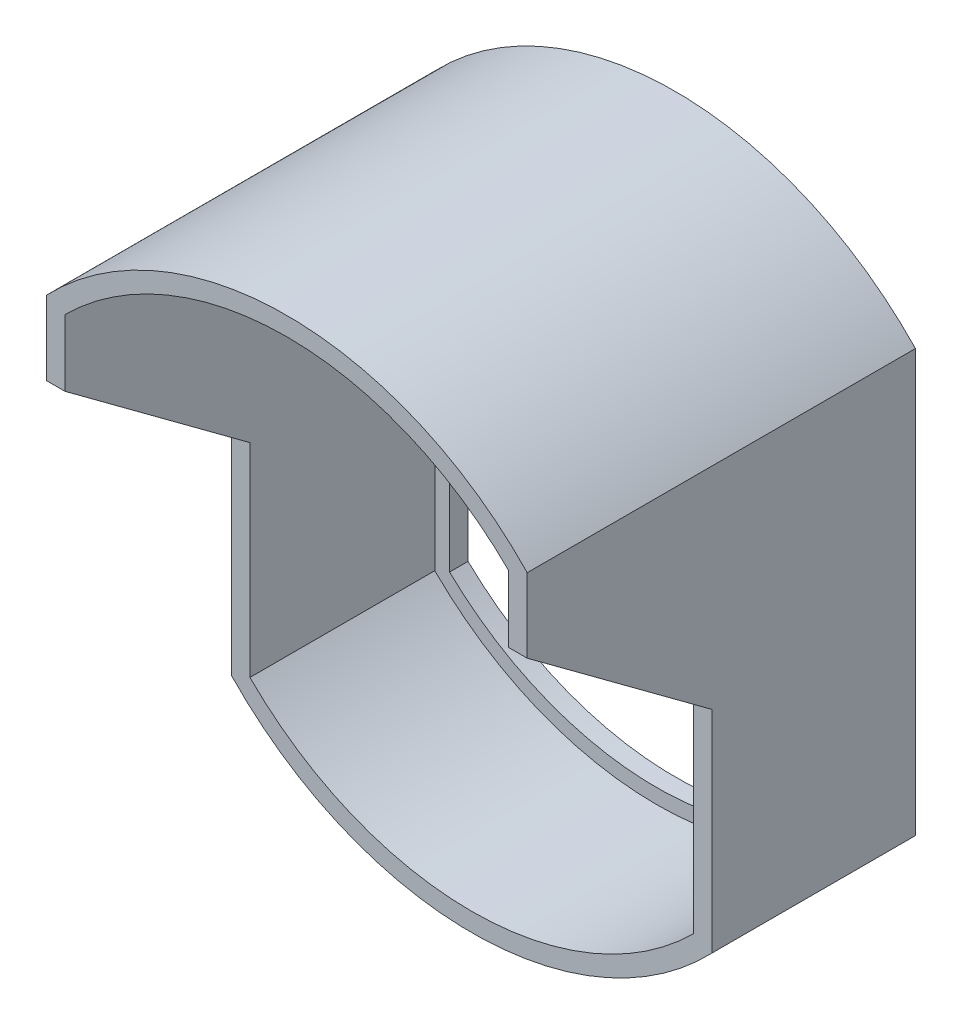
ISO-10303-21;
HEADER;
FILE_DESCRIPTION(('STEP AP214'),'2;1');
FILE_NAME('part.step','',(''),(''),'','','');
FILE_SCHEMA(('AUTOMOTIVE_DESIGN { 1 0 10303 214 1 1 1 1 }'));
ENDSEC;
DATA;
#1=APPLICATION_CONTEXT('core data for automotive mechanical design processes');
#2=APPLICATION_PROTOCOL_DEFINITION('international standard','automotive_design',2000,#1);
#3=PRODUCT_CONTEXT('',#1,'mechanical');
#4=PRODUCT('Part','Part','',(#3));
#5=PRODUCT_RELATED_PRODUCT_CATEGORY('part','',(#4));
#6=PRODUCT_DEFINITION_FORMATION('','',#4);
#7=PRODUCT_DEFINITION_CONTEXT('part definition',#1,'design');
#8=PRODUCT_DEFINITION('design','',#6,#7);
#9=PRODUCT_DEFINITION_SHAPE('','',#8);
#10=(LENGTH_UNIT() NAMED_UNIT(*) SI_UNIT(.MILLI.,.METRE.));
#11=(NAMED_UNIT(*) PLANE_ANGLE_UNIT() SI_UNIT($,.RADIAN.));
#12=(NAMED_UNIT(*) SI_UNIT($,.STERADIAN.) SOLID_ANGLE_UNIT());
#13=UNCERTAINTY_MEASURE_WITH_UNIT(LENGTH_MEASURE(1.E-05),#10,'distance_accuracy_value','');
#14=(GEOMETRIC_REPRESENTATION_CONTEXT(3) GLOBAL_UNCERTAINTY_ASSIGNED_CONTEXT((#13)) GLOBAL_UNIT_ASSIGNED_CONTEXT((#10,
#11,#12)) REPRESENTATION_CONTEXT('',''));
#15=CARTESIAN_POINT('',(0.,0.,0.));
#16=DIRECTION('',(0.,0.,1.));
#17=DIRECTION('',(1.,0.,0.));
#18=AXIS2_PLACEMENT_3D('',#15,#16,#17);
#19=CARTESIAN_POINT('',(120.,-110.,100.));
#20=DIRECTION('',(1.,0.,0.));
#21=DIRECTION('',(0.,1.,0.));
#22=AXIS2_PLACEMENT_3D('',#19,#20,#21);
#23=PLANE('',#22);
#24=DIRECTION('',(0.,0.,-1.));
#25=VECTOR('',#24,1.);
#26=CARTESIAN_POINT('',(120.,-110.,100.));
#27=LINE('',#26,#25);
#28=CARTESIAN_POINT('',(120.,-110.,50.));
#29=VERTEX_POINT('',#28);
#30=CARTESIAN_POINT('',(120.,-110.,0.));
#31=VERTEX_POINT('',#30);
#32=EDGE_CURVE('E240',#29,#31,#27,.T.);
#33=ORIENTED_EDGE('',*,*,#32,.F.);
#34=DIRECTION('',(0.,1.,0.));
#35=VECTOR('',#34,1.);
#36=CARTESIAN_POINT('',(120.,-110.,50.));
#37=LINE('',#36,#35);
#38=CARTESIAN_POINT('',(120.,-55.,50.));
#39=VERTEX_POINT('',#38);
#40=EDGE_CURVE('E230',#29,#39,#37,.T.);
#41=ORIENTED_EDGE('',*,*,#40,.T.);
#42=DIRECTION('',(0.,0.594904677446047,0.803796258235142));
#43=VECTOR('',#42,1.);
#44=CARTESIAN_POINT('',(120.,-50.5560289517094,56.0044027820663));
#45=LINE('',#44,#43);
#46=CARTESIAN_POINT('',(120.,-17.9940627770368,100.));
#47=VERTEX_POINT('',#46);
#48=EDGE_CURVE('E217',#39,#47,#45,.T.);
#49=ORIENTED_EDGE('',*,*,#48,.T.);
#50=DIRECTION('',(0.,-1.,0.));
#51=VECTOR('',#50,1.);
#52=CARTESIAN_POINT('',(120.,-110.,100.));
#53=LINE('',#52,#51);
#54=CARTESIAN_POINT('',(120.,0.,100.));
#55=VERTEX_POINT('',#54);
#56=EDGE_CURVE('E236',#55,#47,#53,.T.);
#57=ORIENTED_EDGE('',*,*,#56,.F.);
#58=DIRECTION('',(0.,0.,-1.));
#59=VECTOR('',#58,1.);
#60=CARTESIAN_POINT('',(120.,0.,100.));
#61=LINE('',#60,#59);
#62=CARTESIAN_POINT('',(120.,0.,0.));
#63=VERTEX_POINT('',#62);
#64=EDGE_CURVE('E244',#55,#63,#61,.T.);
#65=ORIENTED_EDGE('',*,*,#64,.T.);
#66=DIRECTION('',(0.,-1.,0.));
#67=VECTOR('',#66,1.);
#68=CARTESIAN_POINT('',(120.,-60.2079728939615,0.));
#69=LINE('',#68,#67);
#70=EDGE_CURVE('E273',#63,#31,#69,.T.);
#71=ORIENTED_EDGE('',*,*,#70,.T.);
#72=EDGE_LOOP('',(#33,#41,#49,#57,#65,#71));
#73=FACE_BOUND('',#72,.T.);
#74=ADVANCED_FACE('F37',(#73),#23,.F.);
#75=CARTESIAN_POINT('',(0.,0.,100.));
#76=DIRECTION('',(-1.,0.,0.));
#77=DIRECTION('',(0.,-1.,0.));
#78=AXIS2_PLACEMENT_3D('',#75,#76,#77);
#79=PLANE('',#78);
#80=DIRECTION('',(0.,-0.594904677446047,-0.803796258235142));
#81=VECTOR('',#80,1.);
#82=CARTESIAN_POINT('',(0.,-11.625755674519,108.604439693215));
#83=LINE('',#82,#81);
#84=CARTESIAN_POINT('',(0.,-17.9940627770368,100.));
#85=VERTEX_POINT('',#84);
#86=CARTESIAN_POINT('',(0.,-55.,50.));
#87=VERTEX_POINT('',#86);
#88=EDGE_CURVE('E214',#85,#87,#83,.T.);
#89=ORIENTED_EDGE('',*,*,#88,.T.);
#90=DIRECTION('',(0.,-1.,0.));
#91=VECTOR('',#90,1.);
#92=CARTESIAN_POINT('',(0.,0.,50.));
#93=LINE('',#92,#91);
#94=CARTESIAN_POINT('',(0.,-110.,50.));
#95=VERTEX_POINT('',#94);
#96=EDGE_CURVE('E227',#87,#95,#93,.T.);
#97=ORIENTED_EDGE('',*,*,#96,.T.);
#98=DIRECTION('',(0.,0.,-1.));
#99=VECTOR('',#98,1.);
#100=CARTESIAN_POINT('',(0.,-110.,100.));
#101=LINE('',#100,#99);
#102=CARTESIAN_POINT('',(0.,-110.,0.));
#103=VERTEX_POINT('',#102);
#104=EDGE_CURVE('E239',#95,#103,#101,.T.);
#105=ORIENTED_EDGE('',*,*,#104,.T.);
#106=DIRECTION('',(0.,1.,0.));
#107=VECTOR('',#106,1.);
#108=CARTESIAN_POINT('',(0.,-60.2079728939615,0.));
#109=LINE('',#108,#107);
#110=CARTESIAN_POINT('',(0.,0.,0.));
#111=VERTEX_POINT('',#110);
#112=EDGE_CURVE('E262',#103,#111,#109,.T.);
#113=ORIENTED_EDGE('',*,*,#112,.T.);
#114=DIRECTION('',(0.,0.,-1.));
#115=VECTOR('',#114,1.);
#116=CARTESIAN_POINT('',(0.,0.,100.));
#117=LINE('',#116,#115);
#118=CARTESIAN_POINT('',(0.,0.,100.));
#119=VERTEX_POINT('',#118);
#120=EDGE_CURVE('E247',#119,#111,#117,.T.);
#121=ORIENTED_EDGE('',*,*,#120,.F.);
#122=DIRECTION('',(0.,1.,0.));
#123=VECTOR('',#122,1.);
#124=CARTESIAN_POINT('',(0.,0.,100.));
#125=LINE('',#124,#123);
#126=EDGE_CURVE('E59',#85,#119,#125,.T.);
#127=ORIENTED_EDGE('',*,*,#126,.F.);
#128=EDGE_LOOP('',(#89,#97,#105,#113,#121,#127));
#129=FACE_BOUND('',#128,.T.);
#130=ADVANCED_FACE('F305',(#129),#79,.F.);
#131=CARTESIAN_POINT('',(60.,-49.7920271060385,100.));
#132=DIRECTION('',(0.,0.,-1.));
#133=DIRECTION('',(-1.,0.,0.));
#134=AXIS2_PLACEMENT_3D('',#131,#132,#133);
#135=CYLINDRICAL_SURFACE('',#134,85.);
#136=ORIENTED_EDGE('',*,*,#104,.F.);
#137=CARTESIAN_POINT('',(60.,-49.7920271060385,50.));
#138=DIRECTION('',(0.,0.,-1.));
#139=DIRECTION('',(0.,1.,0.));
#140=AXIS2_PLACEMENT_3D('',#137,#138,#139);
#141=CIRCLE('',#140,85.);
#142=EDGE_CURVE('E224',#95,#29,#141,.F.);
#143=ORIENTED_EDGE('',*,*,#142,.T.);
#144=ORIENTED_EDGE('',*,*,#32,.T.);
#145=CARTESIAN_POINT('',(60.,-49.7920271060385,0.));
#146=DIRECTION('',(0.,0.,-1.));
#147=DIRECTION('',(-1.,0.,0.));
#148=AXIS2_PLACEMENT_3D('',#145,#146,#147);
#149=CIRCLE('',#148,85.);
#150=EDGE_CURVE('E270',#31,#103,#149,.T.);
#151=ORIENTED_EDGE('',*,*,#150,.T.);
#152=EDGE_LOOP('',(#136,#143,#144,#151));
#153=FACE_BOUND('',#152,.T.);
#154=ADVANCED_FACE('F307',(#153),#135,.F.);
#155=CARTESIAN_POINT('',(60.,-60.2079728939615,100.));
#156=DIRECTION('',(0.,0.,-1.));
#157=DIRECTION('',(-1.,0.,0.));
#158=AXIS2_PLACEMENT_3D('',#155,#156,#157);
#159=CYLINDRICAL_SURFACE('',#158,85.);
#160=ORIENTED_EDGE('',*,*,#120,.T.);
#161=CARTESIAN_POINT('',(60.,-60.2079728939615,0.));
#162=DIRECTION('',(0.,0.,-1.));
#163=DIRECTION('',(-1.,0.,0.));
#164=AXIS2_PLACEMENT_3D('',#161,#162,#163);
#165=CIRCLE('',#164,85.);
#166=EDGE_CURVE('E275',#111,#63,#165,.T.);
#167=ORIENTED_EDGE('',*,*,#166,.T.);
#168=ORIENTED_EDGE('',*,*,#64,.F.);
#169=CARTESIAN_POINT('',(60.,-60.2079728939615,100.));
#170=DIRECTION('',(0.,0.,-1.));
#171=DIRECTION('',(-1.,0.,0.));
#172=AXIS2_PLACEMENT_3D('',#169,#170,#171);
#173=CIRCLE('',#172,85.);
#174=EDGE_CURVE('E234',#119,#55,#173,.T.);
#175=ORIENTED_EDGE('',*,*,#174,.F.);
#176=EDGE_LOOP('',(#160,#167,#168,#175));
#177=FACE_BOUND('',#176,.T.);
#178=ADVANCED_FACE('F313',(#177),#159,.F.);
#179=CARTESIAN_POINT('',(60.,-60.2079728939615,100.));
#180=DIRECTION('',(0.,0.,-1.));
#181=DIRECTION('',(-1.,0.,0.));
#182=AXIS2_PLACEMENT_3D('',#179,#180,#181);
#183=CYLINDRICAL_SURFACE('',#182,90.);
#184=DIRECTION('',(0.,0.,-1.));
#185=VECTOR('',#184,1.);
#186=CARTESIAN_POINT('',(125.,2.04152509598219,100.));
#187=LINE('',#186,#185);
#188=CARTESIAN_POINT('',(125.,2.04152509598219,100.));
#189=VERTEX_POINT('',#188);
#190=CARTESIAN_POINT('',(125.,2.0415250959822,-5.));
#191=VERTEX_POINT('',#190);
#192=EDGE_CURVE('E259',#189,#191,#187,.T.);
#193=ORIENTED_EDGE('',*,*,#192,.T.);
#194=CARTESIAN_POINT('',(60.,-60.2079728939615,-5.));
#195=DIRECTION('',(0.,0.,-1.));
#196=DIRECTION('',(-1.,0.,0.));
#197=AXIS2_PLACEMENT_3D('',#194,#195,#196);
#198=CIRCLE('',#197,90.);
#199=CARTESIAN_POINT('',(-5.00000000000001,2.04152509598218,-5.));
#200=VERTEX_POINT('',#199);
#201=EDGE_CURVE('E170',#200,#191,#198,.T.);
#202=ORIENTED_EDGE('',*,*,#201,.F.);
#203=DIRECTION('',(0.,0.,-1.));
#204=VECTOR('',#203,1.);
#205=CARTESIAN_POINT('',(-5.,2.04152509598217,100.));
#206=LINE('',#205,#204);
#207=CARTESIAN_POINT('',(-5.,2.04152509598217,100.));
#208=VERTEX_POINT('',#207);
#209=EDGE_CURVE('E260',#208,#200,#206,.T.);
#210=ORIENTED_EDGE('',*,*,#209,.F.);
#211=CARTESIAN_POINT('',(60.,-60.2079728939615,100.));
#212=DIRECTION('',(0.,0.,-1.));
#213=DIRECTION('',(-1.,0.,0.));
#214=AXIS2_PLACEMENT_3D('',#211,#212,#213);
#215=CIRCLE('',#214,90.);
#216=EDGE_CURVE('E243',#208,#189,#215,.T.);
#217=ORIENTED_EDGE('',*,*,#216,.T.);
#218=EDGE_LOOP('',(#193,#202,#210,#217));
#219=FACE_BOUND('',#218,.T.);
#220=ADVANCED_FACE('F39',(#219),#183,.T.);
#221=CARTESIAN_POINT('',(-5.00000000000001,-112.041525095982,100.));
#222=DIRECTION('',(-1.,0.,0.));
#223=DIRECTION('',(0.,-1.,0.));
#224=AXIS2_PLACEMENT_3D('',#221,#222,#223);
#225=PLANE('',#224);
#226=DIRECTION('',(0.,-1.,0.));
#227=VECTOR('',#226,1.);
#228=CARTESIAN_POINT('',(-5.00000000000001,-112.041525095982,50.));
#229=LINE('',#228,#227);
#230=CARTESIAN_POINT('',(-5.,-55.,50.));
#231=VERTEX_POINT('',#230);
#232=CARTESIAN_POINT('',(-5.00000000000001,-112.041525095982,50.));
#233=VERTEX_POINT('',#232);
#234=EDGE_CURVE('E222',#231,#233,#229,.T.);
#235=ORIENTED_EDGE('',*,*,#234,.F.);
#236=DIRECTION('',(0.,-0.594904677446047,-0.803796258235142));
#237=VECTOR('',#236,1.);
#238=CARTESIAN_POINT('',(-5.00000000000001,-51.2785483143351,55.02818191476));
#239=LINE('',#238,#237);
#240=CARTESIAN_POINT('',(-5.00000000000002,-17.9940627770368,100.));
#241=VERTEX_POINT('',#240);
#242=EDGE_CURVE('E212',#241,#231,#239,.T.);
#243=ORIENTED_EDGE('',*,*,#242,.F.);
#244=DIRECTION('',(0.,1.,0.));
#245=VECTOR('',#244,1.);
#246=CARTESIAN_POINT('',(-5.00000000000001,-112.041525095982,100.));
#247=LINE('',#246,#245);
#248=EDGE_CURVE('E257',#241,#208,#247,.T.);
#249=ORIENTED_EDGE('',*,*,#248,.T.);
#250=ORIENTED_EDGE('',*,*,#209,.T.);
#251=DIRECTION('',(0.,1.,0.));
#252=VECTOR('',#251,1.);
#253=CARTESIAN_POINT('',(-4.99999999999997,-112.041525095982,-5.));
#254=LINE('',#253,#252);
#255=CARTESIAN_POINT('',(-4.99999999999997,-112.041525095982,-5.));
#256=VERTEX_POINT('',#255);
#257=EDGE_CURVE('E202',#256,#200,#254,.T.);
#258=ORIENTED_EDGE('',*,*,#257,.F.);
#259=DIRECTION('',(0.,0.,-1.));
#260=VECTOR('',#259,1.);
#261=CARTESIAN_POINT('',(-5.00000000000001,-112.041525095982,100.));
#262=LINE('',#261,#260);
#263=EDGE_CURVE('E263',#233,#256,#262,.T.);
#264=ORIENTED_EDGE('',*,*,#263,.F.);
#265=EDGE_LOOP('',(#235,#243,#249,#250,#258,#264));
#266=FACE_BOUND('',#265,.T.);
#267=ADVANCED_FACE('F293',(#266),#225,.T.);
#268=CARTESIAN_POINT('',(60.,-49.7920271060385,100.));
#269=DIRECTION('',(0.,0.,-1.));
#270=DIRECTION('',(-1.,0.,0.));
#271=AXIS2_PLACEMENT_3D('',#268,#269,#270);
#272=CYLINDRICAL_SURFACE('',#271,90.);
#273=CARTESIAN_POINT('',(60.,-49.7920271060385,50.));
#274=DIRECTION('',(0.,0.,-1.));
#275=DIRECTION('',(0.,1.,0.));
#276=AXIS2_PLACEMENT_3D('',#273,#274,#275);
#277=CIRCLE('',#276,90.);
#278=CARTESIAN_POINT('',(125.,-112.041525095982,50.));
#279=VERTEX_POINT('',#278);
#280=EDGE_CURVE('E220',#233,#279,#277,.F.);
#281=ORIENTED_EDGE('',*,*,#280,.F.);
#282=ORIENTED_EDGE('',*,*,#263,.T.);
#283=CARTESIAN_POINT('',(60.,-49.7920271060385,-5.));
#284=DIRECTION('',(0.,0.,-1.));
#285=DIRECTION('',(-1.,0.,0.));
#286=AXIS2_PLACEMENT_3D('',#283,#284,#285);
#287=CIRCLE('',#286,90.);
#288=CARTESIAN_POINT('',(125.,-112.041525095982,-5.));
#289=VERTEX_POINT('',#288);
#290=EDGE_CURVE('E199',#289,#256,#287,.T.);
#291=ORIENTED_EDGE('',*,*,#290,.F.);
#292=DIRECTION('',(0.,0.,-1.));
#293=VECTOR('',#292,1.);
#294=CARTESIAN_POINT('',(125.,-112.041525095982,100.));
#295=LINE('',#294,#293);
#296=EDGE_CURVE('E265',#279,#289,#295,.T.);
#297=ORIENTED_EDGE('',*,*,#296,.F.);
#298=EDGE_LOOP('',(#281,#282,#291,#297));
#299=FACE_BOUND('',#298,.T.);
#300=ADVANCED_FACE('F320',(#299),#272,.T.);
#301=CARTESIAN_POINT('',(125.,2.04152509598219,100.));
#302=DIRECTION('',(1.,0.,0.));
#303=DIRECTION('',(0.,1.,0.));
#304=AXIS2_PLACEMENT_3D('',#301,#302,#303);
#305=PLANE('',#304);
#306=DIRECTION('',(0.,1.,0.));
#307=VECTOR('',#306,1.);
#308=CARTESIAN_POINT('',(125.,-175.493521459003,50.));
#309=LINE('',#308,#307);
#310=CARTESIAN_POINT('',(125.,-55.,50.));
#311=VERTEX_POINT('',#310);
#312=EDGE_CURVE('E205',#279,#311,#309,.T.);
#313=ORIENTED_EDGE('',*,*,#312,.F.);
#314=ORIENTED_EDGE('',*,*,#296,.T.);
#315=DIRECTION('',(0.,-1.,0.));
#316=VECTOR('',#315,1.);
#317=CARTESIAN_POINT('',(125.,2.0415250959822,-5.));
#318=LINE('',#317,#316);
#319=EDGE_CURVE('E196',#191,#289,#318,.T.);
#320=ORIENTED_EDGE('',*,*,#319,.F.);
#321=ORIENTED_EDGE('',*,*,#192,.F.);
#322=DIRECTION('',(0.,-1.,0.));
#323=VECTOR('',#322,1.);
#324=CARTESIAN_POINT('',(125.,2.04152509598219,100.));
#325=LINE('',#324,#323);
#326=CARTESIAN_POINT('',(125.,-17.9940627770368,100.));
#327=VERTEX_POINT('',#326);
#328=EDGE_CURVE('E254',#189,#327,#325,.T.);
#329=ORIENTED_EDGE('',*,*,#328,.T.);
#330=DIRECTION('',(0.,0.594904677446047,0.803796258235142));
#331=VECTOR('',#330,1.);
#332=CARTESIAN_POINT('',(125.,-55.,50.));
#333=LINE('',#332,#331);
#334=EDGE_CURVE('E52',#311,#327,#333,.T.);
#335=ORIENTED_EDGE('',*,*,#334,.F.);
#336=EDGE_LOOP('',(#313,#314,#320,#321,#329,#335));
#337=FACE_BOUND('',#336,.T.);
#338=ADVANCED_FACE('F285',(#337),#305,.T.);
#339=CARTESIAN_POINT('',(60.,-60.2079728939615,100.));
#340=DIRECTION('',(0.,0.,-1.));
#341=DIRECTION('',(-1.,0.,0.));
#342=AXIS2_PLACEMENT_3D('',#339,#340,#341);
#343=PLANE('',#342);
#344=ORIENTED_EDGE('',*,*,#248,.F.);
#345=DIRECTION('',(1.,0.,0.));
#346=VECTOR('',#345,1.);
#347=CARTESIAN_POINT('',(60.,-17.9940627770368,100.));
#348=LINE('',#347,#346);
#349=EDGE_CURVE('E11',#241,#85,#348,.T.);
#350=ORIENTED_EDGE('',*,*,#349,.T.);
#351=ORIENTED_EDGE('',*,*,#126,.T.);
#352=ORIENTED_EDGE('',*,*,#174,.T.);
#353=ORIENTED_EDGE('',*,*,#56,.T.);
#354=EDGE_CURVE('E41',#47,#327,#348,.T.);
#355=ORIENTED_EDGE('',*,*,#354,.T.);
#356=ORIENTED_EDGE('',*,*,#328,.F.);
#357=ORIENTED_EDGE('',*,*,#216,.F.);
#358=EDGE_LOOP('',(#344,#350,#351,#352,#353,#355,#356,#357));
#359=FACE_BOUND('',#358,.T.);
#360=ADVANCED_FACE('F280',(#359),#343,.F.);
#361=CARTESIAN_POINT('',(-44.,-175.493521459003,50.));
#362=DIRECTION('',(0.,0.,-1.));
#363=DIRECTION('',(0.,1.,0.));
#364=AXIS2_PLACEMENT_3D('',#361,#362,#363);
#365=PLANE('',#364);
#366=ORIENTED_EDGE('',*,*,#142,.F.);
#367=ORIENTED_EDGE('',*,*,#96,.F.);
#368=DIRECTION('',(1.,0.,0.));
#369=VECTOR('',#368,1.);
#370=CARTESIAN_POINT('',(-44.,-55.,50.));
#371=LINE('',#370,#369);
#372=EDGE_CURVE('E211',#231,#87,#371,.T.);
#373=ORIENTED_EDGE('',*,*,#372,.F.);
#374=ORIENTED_EDGE('',*,*,#234,.T.);
#375=ORIENTED_EDGE('',*,*,#280,.T.);
#376=ORIENTED_EDGE('',*,*,#312,.T.);
#377=EDGE_CURVE('E209',#39,#311,#371,.T.);
#378=ORIENTED_EDGE('',*,*,#377,.F.);
#379=ORIENTED_EDGE('',*,*,#40,.F.);
#380=EDGE_LOOP('',(#366,#367,#373,#374,#375,#376,#378,#379));
#381=FACE_BOUND('',#380,.T.);
#382=ADVANCED_FACE('F301',(#381),#365,.F.);
#383=CARTESIAN_POINT('',(-44.,-55.,50.));
#384=DIRECTION('',(0.,0.803796258235142,-0.594904677446047));
#385=DIRECTION('',(0.,0.594904677446047,0.803796258235142));
#386=AXIS2_PLACEMENT_3D('',#383,#384,#385);
#387=PLANE('',#386);
#388=ORIENTED_EDGE('',*,*,#377,.T.);
#389=ORIENTED_EDGE('',*,*,#334,.T.);
#390=ORIENTED_EDGE('',*,*,#354,.F.);
#391=ORIENTED_EDGE('',*,*,#48,.F.);
#392=EDGE_LOOP('',(#388,#389,#390,#391));
#393=FACE_BOUND('',#392,.T.);
#394=ADVANCED_FACE('F316',(#393),#387,.F.);
#395=ORIENTED_EDGE('',*,*,#349,.F.);
#396=ORIENTED_EDGE('',*,*,#242,.T.);
#397=ORIENTED_EDGE('',*,*,#372,.T.);
#398=ORIENTED_EDGE('',*,*,#88,.F.);
#399=EDGE_LOOP('',(#395,#396,#397,#398));
#400=FACE_BOUND('',#399,.T.);
#401=ADVANCED_FACE('F299',(#400),#387,.F.);
#402=CARTESIAN_POINT('',(60.,-60.2079728939615,-5.));
#403=DIRECTION('',(0.,0.,-1.));
#404=DIRECTION('',(-1.,0.,0.));
#405=AXIS2_PLACEMENT_3D('',#402,#403,#404);
#406=PLANE('',#405);
#407=ORIENTED_EDGE('',*,*,#201,.T.);
#408=ORIENTED_EDGE('',*,*,#319,.T.);
#409=ORIENTED_EDGE('',*,*,#290,.T.);
#410=ORIENTED_EDGE('',*,*,#257,.T.);
#411=EDGE_LOOP('',(#407,#408,#409,#410));
#412=FACE_BOUND('',#411,.T.);
#413=DIRECTION('',(0.,-1.,0.));
#414=VECTOR('',#413,1.);
#415=CARTESIAN_POINT('',(116.,-1.68447334036336,-5.));
#416=LINE('',#415,#414);
#417=CARTESIAN_POINT('',(116.,-1.68447334036336,-5.));
#418=VERTEX_POINT('',#417);
#419=CARTESIAN_POINT('',(116.,-108.315526659637,-5.));
#420=VERTEX_POINT('',#419);
#421=EDGE_CURVE('E162',#418,#420,#416,.T.);
#422=ORIENTED_EDGE('',*,*,#421,.F.);
#423=CARTESIAN_POINT('',(60.,-60.2079728939615,-5.));
#424=DIRECTION('',(0.,0.,-1.));
#425=DIRECTION('',(-1.,0.,0.));
#426=AXIS2_PLACEMENT_3D('',#423,#424,#425);
#427=CIRCLE('',#426,81.);
#428=CARTESIAN_POINT('',(4.,-1.68447334036334,-5.));
#429=VERTEX_POINT('',#428);
#430=EDGE_CURVE('E152',#429,#418,#427,.T.);
#431=ORIENTED_EDGE('',*,*,#430,.F.);
#432=DIRECTION('',(0.,1.,0.));
#433=VECTOR('',#432,1.);
#434=CARTESIAN_POINT('',(3.99999999999999,-108.315526659637,-5.));
#435=LINE('',#434,#433);
#436=CARTESIAN_POINT('',(3.99999999999999,-108.315526659637,-5.));
#437=VERTEX_POINT('',#436);
#438=EDGE_CURVE('E178',#437,#429,#435,.T.);
#439=ORIENTED_EDGE('',*,*,#438,.F.);
#440=CARTESIAN_POINT('',(60.,-49.7920271060385,-5.));
#441=DIRECTION('',(0.,0.,-1.));
#442=DIRECTION('',(-1.,0.,0.));
#443=AXIS2_PLACEMENT_3D('',#440,#441,#442);
#444=CIRCLE('',#443,81.);
#445=EDGE_CURVE('E176',#420,#437,#444,.T.);
#446=ORIENTED_EDGE('',*,*,#445,.F.);
#447=EDGE_LOOP('',(#422,#431,#439,#446));
#448=FACE_BOUND('',#447,.T.);
#449=ADVANCED_FACE('F174',(#412,#448),#406,.T.);
#450=CARTESIAN_POINT('',(60.,-60.2079728939615,0.));
#451=DIRECTION('',(0.,0.,-1.));
#452=DIRECTION('',(-1.,0.,0.));
#453=AXIS2_PLACEMENT_3D('',#450,#451,#452);
#454=PLANE('',#453);
#455=ORIENTED_EDGE('',*,*,#166,.F.);
#456=ORIENTED_EDGE('',*,*,#112,.F.);
#457=ORIENTED_EDGE('',*,*,#150,.F.);
#458=ORIENTED_EDGE('',*,*,#70,.F.);
#459=EDGE_LOOP('',(#455,#456,#457,#458));
#460=FACE_BOUND('',#459,.T.);
#461=CARTESIAN_POINT('',(60.,-60.2079728939615,0.));
#462=DIRECTION('',(0.,0.,-1.));
#463=DIRECTION('',(-1.,0.,0.));
#464=AXIS2_PLACEMENT_3D('',#461,#462,#463);
#465=CIRCLE('',#464,81.);
#466=CARTESIAN_POINT('',(3.99999999999999,-1.68447334036334,0.));
#467=VERTEX_POINT('',#466);
#468=CARTESIAN_POINT('',(116.,-1.68447334036336,0.));
#469=VERTEX_POINT('',#468);
#470=EDGE_CURVE('E182',#467,#469,#465,.T.);
#471=ORIENTED_EDGE('',*,*,#470,.T.);
#472=DIRECTION('',(0.,-1.,0.));
#473=VECTOR('',#472,1.);
#474=CARTESIAN_POINT('',(116.,-1.68447334036336,0.));
#475=LINE('',#474,#473);
#476=CARTESIAN_POINT('',(116.,-108.315526659637,0.));
#477=VERTEX_POINT('',#476);
#478=EDGE_CURVE('E169',#469,#477,#475,.T.);
#479=ORIENTED_EDGE('',*,*,#478,.T.);
#480=CARTESIAN_POINT('',(60.,-49.7920271060385,0.));
#481=DIRECTION('',(0.,0.,-1.));
#482=DIRECTION('',(-1.,0.,0.));
#483=AXIS2_PLACEMENT_3D('',#480,#481,#482);
#484=CIRCLE('',#483,81.);
#485=CARTESIAN_POINT('',(3.99999999999999,-108.315526659637,0.));
#486=VERTEX_POINT('',#485);
#487=EDGE_CURVE('E185',#477,#486,#484,.T.);
#488=ORIENTED_EDGE('',*,*,#487,.T.);
#489=DIRECTION('',(0.,1.,0.));
#490=VECTOR('',#489,1.);
#491=CARTESIAN_POINT('',(3.99999999999999,-108.315526659637,0.));
#492=LINE('',#491,#490);
#493=EDGE_CURVE('E163',#486,#467,#492,.T.);
#494=ORIENTED_EDGE('',*,*,#493,.T.);
#495=EDGE_LOOP('',(#471,#479,#488,#494));
#496=FACE_BOUND('',#495,.T.);
#497=ADVANCED_FACE('F310',(#460,#496),#454,.F.);
#498=CARTESIAN_POINT('',(60.,-60.2079728939615,-5.));
#499=DIRECTION('',(0.,0.,1.));
#500=DIRECTION('',(1.,0.,0.));
#501=AXIS2_PLACEMENT_3D('',#498,#499,#500);
#502=CYLINDRICAL_SURFACE('',#501,81.);
#503=ORIENTED_EDGE('',*,*,#470,.F.);
#504=DIRECTION('',(0.,0.,1.));
#505=VECTOR('',#504,1.);
#506=CARTESIAN_POINT('',(4.,-1.68447334036334,-5.));
#507=LINE('',#506,#505);
#508=EDGE_CURVE('E158',#429,#467,#507,.T.);
#509=ORIENTED_EDGE('',*,*,#508,.F.);
#510=ORIENTED_EDGE('',*,*,#430,.T.);
#511=DIRECTION('',(0.,0.,1.));
#512=VECTOR('',#511,1.);
#513=CARTESIAN_POINT('',(116.,-1.68447334036336,-5.));
#514=LINE('',#513,#512);
#515=EDGE_CURVE('E155',#418,#469,#514,.T.);
#516=ORIENTED_EDGE('',*,*,#515,.T.);
#517=EDGE_LOOP('',(#503,#509,#510,#516));
#518=FACE_BOUND('',#517,.T.);
#519=ADVANCED_FACE('F154',(#518),#502,.F.);
#520=CARTESIAN_POINT('',(116.,-1.68447334036336,-5.));
#521=DIRECTION('',(-1.,0.,0.));
#522=DIRECTION('',(0.,-1.,0.));
#523=AXIS2_PLACEMENT_3D('',#520,#521,#522);
#524=PLANE('',#523);
#525=ORIENTED_EDGE('',*,*,#478,.F.);
#526=ORIENTED_EDGE('',*,*,#515,.F.);
#527=ORIENTED_EDGE('',*,*,#421,.T.);
#528=DIRECTION('',(0.,0.,1.));
#529=VECTOR('',#528,1.);
#530=CARTESIAN_POINT('',(116.,-108.315526659637,-5.));
#531=LINE('',#530,#529);
#532=EDGE_CURVE('E171',#420,#477,#531,.T.);
#533=ORIENTED_EDGE('',*,*,#532,.T.);
#534=EDGE_LOOP('',(#525,#526,#527,#533));
#535=FACE_BOUND('',#534,.T.);
#536=ADVANCED_FACE('F166',(#535),#524,.T.);
#537=CARTESIAN_POINT('',(60.,-49.7920271060385,-5.));
#538=DIRECTION('',(0.,0.,1.));
#539=DIRECTION('',(1.,0.,0.));
#540=AXIS2_PLACEMENT_3D('',#537,#538,#539);
#541=CYLINDRICAL_SURFACE('',#540,81.);
#542=ORIENTED_EDGE('',*,*,#487,.F.);
#543=ORIENTED_EDGE('',*,*,#532,.F.);
#544=ORIENTED_EDGE('',*,*,#445,.T.);
#545=DIRECTION('',(0.,0.,1.));
#546=VECTOR('',#545,1.);
#547=CARTESIAN_POINT('',(3.99999999999999,-108.315526659637,-5.));
#548=LINE('',#547,#546);
#549=EDGE_CURVE('E191',#437,#486,#548,.T.);
#550=ORIENTED_EDGE('',*,*,#549,.T.);
#551=EDGE_LOOP('',(#542,#543,#544,#550));
#552=FACE_BOUND('',#551,.T.);
#553=ADVANCED_FACE('F449',(#552),#541,.F.);
#554=CARTESIAN_POINT('',(3.99999999999999,-108.315526659637,-5.));
#555=DIRECTION('',(1.,0.,0.));
#556=DIRECTION('',(0.,1.,0.));
#557=AXIS2_PLACEMENT_3D('',#554,#555,#556);
#558=PLANE('',#557);
#559=ORIENTED_EDGE('',*,*,#493,.F.);
#560=ORIENTED_EDGE('',*,*,#549,.F.);
#561=ORIENTED_EDGE('',*,*,#438,.T.);
#562=ORIENTED_EDGE('',*,*,#508,.T.);
#563=EDGE_LOOP('',(#559,#560,#561,#562));
#564=FACE_BOUND('',#563,.T.);
#565=ADVANCED_FACE('F457',(#564),#558,.T.);
#566=CLOSED_SHELL('',(#74,#130,#154,#178,#220,#267,#300,#338,#360,#382,#394,#401,#449,#497,#519,
#536,#553,#565));
#567=MANIFOLD_SOLID_BREP('B2',#566);
#568=ADVANCED_BREP_SHAPE_REPRESENTATION('',(#18,#567),#14);
#569=SHAPE_DEFINITION_REPRESENTATION(#9,#568);
ENDSEC;
END-ISO-10303-21;
